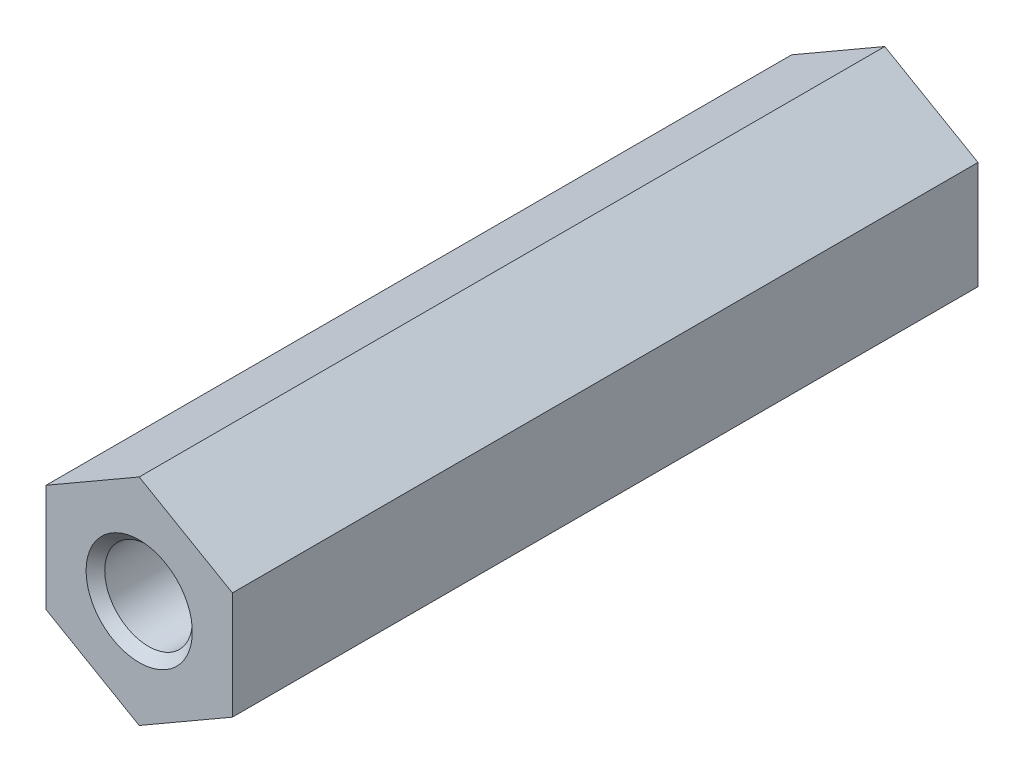
ISO-10303-21;
HEADER;
FILE_DESCRIPTION(('STEP AP214'),'2;1');
FILE_NAME('part.step','',(''),(''),'','','');
FILE_SCHEMA(('AUTOMOTIVE_DESIGN { 1 0 10303 214 1 1 1 1 }'));
ENDSEC;
DATA;
#1=APPLICATION_CONTEXT('core data for automotive mechanical design processes');
#2=APPLICATION_PROTOCOL_DEFINITION('international standard','automotive_design',2000,#1);
#3=PRODUCT_CONTEXT('',#1,'mechanical');
#4=PRODUCT('Part','Part','',(#3));
#5=PRODUCT_RELATED_PRODUCT_CATEGORY('part','',(#4));
#6=PRODUCT_DEFINITION_FORMATION('','',#4);
#7=PRODUCT_DEFINITION_CONTEXT('part definition',#1,'design');
#8=PRODUCT_DEFINITION('design','',#6,#7);
#9=PRODUCT_DEFINITION_SHAPE('','',#8);
#10=(LENGTH_UNIT() NAMED_UNIT(*) SI_UNIT(.MILLI.,.METRE.));
#11=(NAMED_UNIT(*) PLANE_ANGLE_UNIT() SI_UNIT($,.RADIAN.));
#12=(NAMED_UNIT(*) SI_UNIT($,.STERADIAN.) SOLID_ANGLE_UNIT());
#13=UNCERTAINTY_MEASURE_WITH_UNIT(LENGTH_MEASURE(1.E-05),#10,'distance_accuracy_value','');
#14=(GEOMETRIC_REPRESENTATION_CONTEXT(3) GLOBAL_UNCERTAINTY_ASSIGNED_CONTEXT((#13)) GLOBAL_UNIT_ASSIGNED_CONTEXT((#10,
#11,#12)) REPRESENTATION_CONTEXT('',''));
#15=CARTESIAN_POINT('',(0.,0.,0.));
#16=DIRECTION('',(0.,0.,1.));
#17=DIRECTION('',(1.,0.,0.));
#18=AXIS2_PLACEMENT_3D('',#15,#16,#17);
#19=CARTESIAN_POINT('',(0.,5.77350277792815,40.));
#20=DIRECTION('',(0.499999999999999,0.866025403784439,0.));
#21=DIRECTION('',(-0.866025403784439,0.499999999999999,0.));
#22=AXIS2_PLACEMENT_3D('',#19,#20,#21);
#23=PLANE('',#22);
#24=DIRECTION('',(0.866025403784439,-0.499999999999999,0.));
#25=VECTOR('',#24,1.);
#26=CARTESIAN_POINT('',(0.,5.77350277792815,0.));
#27=LINE('',#26,#25);
#28=CARTESIAN_POINT('',(0.,5.77350277792815,0.));
#29=VERTEX_POINT('',#28);
#30=CARTESIAN_POINT('',(5.00000007450581,2.88675138896408,0.));
#31=VERTEX_POINT('',#30);
#32=EDGE_CURVE('E127',#29,#31,#27,.T.);
#33=ORIENTED_EDGE('',*,*,#32,.F.);
#34=DIRECTION('',(0.,0.,-1.));
#35=VECTOR('',#34,1.);
#36=CARTESIAN_POINT('',(0.,5.77350277792815,40.));
#37=LINE('',#36,#35);
#38=CARTESIAN_POINT('',(0.,5.77350277792815,40.));
#39=VERTEX_POINT('',#38);
#40=EDGE_CURVE('E56',#39,#29,#37,.T.);
#41=ORIENTED_EDGE('',*,*,#40,.F.);
#42=DIRECTION('',(0.866025403784439,-0.499999999999999,0.));
#43=VECTOR('',#42,1.);
#44=CARTESIAN_POINT('',(0.,5.77350277792815,40.));
#45=LINE('',#44,#43);
#46=CARTESIAN_POINT('',(5.00000007450581,2.88675138896408,40.));
#47=VERTEX_POINT('',#46);
#48=EDGE_CURVE('E142',#39,#47,#45,.T.);
#49=ORIENTED_EDGE('',*,*,#48,.T.);
#50=DIRECTION('',(0.,0.,-1.));
#51=VECTOR('',#50,1.);
#52=CARTESIAN_POINT('',(5.00000007450581,2.88675138896408,40.));
#53=LINE('',#52,#51);
#54=EDGE_CURVE('E91',#47,#31,#53,.T.);
#55=ORIENTED_EDGE('',*,*,#54,.T.);
#56=EDGE_LOOP('',(#33,#41,#49,#55));
#57=FACE_BOUND('',#56,.T.);
#58=ADVANCED_FACE('F38',(#57),#23,.T.);
#59=CARTESIAN_POINT('',(-5.0000000745058,2.88675138896408,40.));
#60=DIRECTION('',(-0.5,0.866025403784439,0.));
#61=DIRECTION('',(-0.866025403784439,-0.5,0.));
#62=AXIS2_PLACEMENT_3D('',#59,#60,#61);
#63=PLANE('',#62);
#64=DIRECTION('',(0.866025403784439,0.5,0.));
#65=VECTOR('',#64,1.);
#66=CARTESIAN_POINT('',(-5.0000000745058,2.88675138896408,0.));
#67=LINE('',#66,#65);
#68=CARTESIAN_POINT('',(-5.0000000745058,2.88675138896408,0.));
#69=VERTEX_POINT('',#68);
#70=EDGE_CURVE('E139',#69,#29,#67,.T.);
#71=ORIENTED_EDGE('',*,*,#70,.F.);
#72=DIRECTION('',(0.,0.,-1.));
#73=VECTOR('',#72,1.);
#74=CARTESIAN_POINT('',(-5.0000000745058,2.88675138896408,40.));
#75=LINE('',#74,#73);
#76=CARTESIAN_POINT('',(-5.0000000745058,2.88675138896408,40.));
#77=VERTEX_POINT('',#76);
#78=EDGE_CURVE('E79',#77,#69,#75,.T.);
#79=ORIENTED_EDGE('',*,*,#78,.F.);
#80=DIRECTION('',(0.866025403784439,0.5,0.));
#81=VECTOR('',#80,1.);
#82=CARTESIAN_POINT('',(-5.0000000745058,2.88675138896408,40.));
#83=LINE('',#82,#81);
#84=EDGE_CURVE('E117',#77,#39,#83,.T.);
#85=ORIENTED_EDGE('',*,*,#84,.T.);
#86=ORIENTED_EDGE('',*,*,#40,.T.);
#87=EDGE_LOOP('',(#71,#79,#85,#86));
#88=FACE_BOUND('',#87,.T.);
#89=ADVANCED_FACE('F186',(#88),#63,.T.);
#90=CARTESIAN_POINT('',(-5.00000007450581,-2.88675138896407,40.));
#91=DIRECTION('',(-1.,0.,0.));
#92=DIRECTION('',(0.,-1.,0.));
#93=AXIS2_PLACEMENT_3D('',#90,#91,#92);
#94=PLANE('',#93);
#95=DIRECTION('',(0.,1.,0.));
#96=VECTOR('',#95,1.);
#97=CARTESIAN_POINT('',(-5.00000007450581,-2.88675138896407,0.));
#98=LINE('',#97,#96);
#99=CARTESIAN_POINT('',(-5.00000007450581,-2.88675138896407,0.));
#100=VERTEX_POINT('',#99);
#101=EDGE_CURVE('E104',#100,#69,#98,.T.);
#102=ORIENTED_EDGE('',*,*,#101,.F.);
#103=DIRECTION('',(0.,0.,-1.));
#104=VECTOR('',#103,1.);
#105=CARTESIAN_POINT('',(-5.00000007450581,-2.88675138896407,40.));
#106=LINE('',#105,#104);
#107=CARTESIAN_POINT('',(-5.00000007450581,-2.88675138896407,40.));
#108=VERTEX_POINT('',#107);
#109=EDGE_CURVE('E99',#108,#100,#106,.T.);
#110=ORIENTED_EDGE('',*,*,#109,.F.);
#111=DIRECTION('',(0.,1.,0.));
#112=VECTOR('',#111,1.);
#113=CARTESIAN_POINT('',(-5.00000007450581,-2.88675138896407,40.));
#114=LINE('',#113,#112);
#115=EDGE_CURVE('E102',#108,#77,#114,.T.);
#116=ORIENTED_EDGE('',*,*,#115,.T.);
#117=ORIENTED_EDGE('',*,*,#78,.T.);
#118=EDGE_LOOP('',(#102,#110,#116,#117));
#119=FACE_BOUND('',#118,.T.);
#120=ADVANCED_FACE('F101',(#119),#94,.T.);
#121=CARTESIAN_POINT('',(0.,-5.77350277792815,40.));
#122=DIRECTION('',(-0.500000000000001,-0.866025403784438,0.));
#123=DIRECTION('',(0.866025403784438,-0.500000000000001,0.));
#124=AXIS2_PLACEMENT_3D('',#121,#122,#123);
#125=PLANE('',#124);
#126=DIRECTION('',(-0.866025403784438,0.500000000000001,0.));
#127=VECTOR('',#126,1.);
#128=CARTESIAN_POINT('',(0.,-5.77350277792815,0.));
#129=LINE('',#128,#127);
#130=CARTESIAN_POINT('',(0.,-5.77350277792815,0.));
#131=VERTEX_POINT('',#130);
#132=EDGE_CURVE('E136',#131,#100,#129,.T.);
#133=ORIENTED_EDGE('',*,*,#132,.F.);
#134=DIRECTION('',(0.,0.,-1.));
#135=VECTOR('',#134,1.);
#136=CARTESIAN_POINT('',(0.,-5.77350277792815,40.));
#137=LINE('',#136,#135);
#138=CARTESIAN_POINT('',(0.,-5.77350277792815,40.));
#139=VERTEX_POINT('',#138);
#140=EDGE_CURVE('E109',#139,#131,#137,.T.);
#141=ORIENTED_EDGE('',*,*,#140,.F.);
#142=DIRECTION('',(-0.866025403784438,0.500000000000001,0.));
#143=VECTOR('',#142,1.);
#144=CARTESIAN_POINT('',(0.,-5.77350277792815,40.));
#145=LINE('',#144,#143);
#146=EDGE_CURVE('E115',#139,#108,#145,.T.);
#147=ORIENTED_EDGE('',*,*,#146,.T.);
#148=ORIENTED_EDGE('',*,*,#109,.T.);
#149=EDGE_LOOP('',(#133,#141,#147,#148));
#150=FACE_BOUND('',#149,.T.);
#151=ADVANCED_FACE('F119',(#150),#125,.T.);
#152=CARTESIAN_POINT('',(5.0000000745058,-2.88675138896408,40.));
#153=DIRECTION('',(0.5,-0.866025403784439,0.));
#154=DIRECTION('',(0.866025403784439,0.5,0.));
#155=AXIS2_PLACEMENT_3D('',#152,#153,#154);
#156=PLANE('',#155);
#157=DIRECTION('',(-0.866025403784439,-0.499999999999999,0.));
#158=VECTOR('',#157,1.);
#159=CARTESIAN_POINT('',(5.0000000745058,-2.88675138896408,0.));
#160=LINE('',#159,#158);
#161=CARTESIAN_POINT('',(5.0000000745058,-2.88675138896408,0.));
#162=VERTEX_POINT('',#161);
#163=EDGE_CURVE('E133',#162,#131,#160,.T.);
#164=ORIENTED_EDGE('',*,*,#163,.F.);
#165=DIRECTION('',(0.,0.,-1.));
#166=VECTOR('',#165,1.);
#167=CARTESIAN_POINT('',(5.0000000745058,-2.88675138896408,40.));
#168=LINE('',#167,#166);
#169=CARTESIAN_POINT('',(5.0000000745058,-2.88675138896408,40.));
#170=VERTEX_POINT('',#169);
#171=EDGE_CURVE('E147',#170,#162,#168,.T.);
#172=ORIENTED_EDGE('',*,*,#171,.F.);
#173=DIRECTION('',(-0.866025403784439,-0.499999999999999,0.));
#174=VECTOR('',#173,1.);
#175=CARTESIAN_POINT('',(5.0000000745058,-2.88675138896408,40.));
#176=LINE('',#175,#174);
#177=EDGE_CURVE('E120',#170,#139,#176,.T.);
#178=ORIENTED_EDGE('',*,*,#177,.T.);
#179=ORIENTED_EDGE('',*,*,#140,.T.);
#180=EDGE_LOOP('',(#164,#172,#178,#179));
#181=FACE_BOUND('',#180,.T.);
#182=ADVANCED_FACE('F183',(#181),#156,.T.);
#183=CARTESIAN_POINT('',(5.00000007450581,2.88675138896408,40.));
#184=DIRECTION('',(1.,0.,0.));
#185=DIRECTION('',(0.,1.,0.));
#186=AXIS2_PLACEMENT_3D('',#183,#184,#185);
#187=PLANE('',#186);
#188=DIRECTION('',(0.,-1.,0.));
#189=VECTOR('',#188,1.);
#190=CARTESIAN_POINT('',(5.00000007450581,2.88675138896408,0.));
#191=LINE('',#190,#189);
#192=EDGE_CURVE('E130',#31,#162,#191,.T.);
#193=ORIENTED_EDGE('',*,*,#192,.F.);
#194=ORIENTED_EDGE('',*,*,#54,.F.);
#195=DIRECTION('',(0.,-1.,0.));
#196=VECTOR('',#195,1.);
#197=CARTESIAN_POINT('',(5.00000007450581,2.88675138896408,40.));
#198=LINE('',#197,#196);
#199=EDGE_CURVE('E122',#47,#170,#198,.T.);
#200=ORIENTED_EDGE('',*,*,#199,.T.);
#201=ORIENTED_EDGE('',*,*,#171,.T.);
#202=EDGE_LOOP('',(#193,#194,#200,#201));
#203=FACE_BOUND('',#202,.T.);
#204=ADVANCED_FACE('F176',(#203),#187,.T.);
#205=CARTESIAN_POINT('',(0.,0.,40.));
#206=DIRECTION('',(0.,0.,-1.));
#207=DIRECTION('',(-1.,0.,0.));
#208=AXIS2_PLACEMENT_3D('',#205,#206,#207);
#209=PLANE('',#208);
#210=CARTESIAN_POINT('',(0.,0.,40.));
#211=DIRECTION('',(0.,0.,-1.));
#212=DIRECTION('',(-1.,0.,0.));
#213=AXIS2_PLACEMENT_3D('',#210,#211,#212);
#214=CIRCLE('',#213,2.84999999999999);
#215=CARTESIAN_POINT('',(-2.84999999999999,0.,40.));
#216=VERTEX_POINT('',#215);
#217=EDGE_CURVE('E11',#216,#216,#214,.T.);
#218=ORIENTED_EDGE('',*,*,#217,.T.);
#219=EDGE_LOOP('',(#218));
#220=FACE_BOUND('',#219,.T.);
#221=ORIENTED_EDGE('',*,*,#48,.F.);
#222=ORIENTED_EDGE('',*,*,#84,.F.);
#223=ORIENTED_EDGE('',*,*,#115,.F.);
#224=ORIENTED_EDGE('',*,*,#146,.F.);
#225=ORIENTED_EDGE('',*,*,#177,.F.);
#226=ORIENTED_EDGE('',*,*,#199,.F.);
#227=EDGE_LOOP('',(#221,#222,#223,#224,#225,#226));
#228=FACE_BOUND('',#227,.T.);
#229=ADVANCED_FACE('F113',(#220,#228),#209,.F.);
#230=CARTESIAN_POINT('',(0.,0.,0.));
#231=DIRECTION('',(0.,0.,-1.));
#232=DIRECTION('',(-1.,0.,0.));
#233=AXIS2_PLACEMENT_3D('',#230,#231,#232);
#234=PLANE('',#233);
#235=CARTESIAN_POINT('',(0.,0.,0.));
#236=DIRECTION('',(0.,0.,-1.));
#237=DIRECTION('',(-1.,0.,0.));
#238=AXIS2_PLACEMENT_3D('',#235,#236,#237);
#239=CIRCLE('',#238,2.84999999999999);
#240=CARTESIAN_POINT('',(-2.84999999999999,0.,0.));
#241=VERTEX_POINT('',#240);
#242=EDGE_CURVE('E48',#241,#241,#239,.F.);
#243=ORIENTED_EDGE('',*,*,#242,.T.);
#244=EDGE_LOOP('',(#243));
#245=FACE_BOUND('',#244,.T.);
#246=ORIENTED_EDGE('',*,*,#32,.T.);
#247=ORIENTED_EDGE('',*,*,#192,.T.);
#248=ORIENTED_EDGE('',*,*,#163,.T.);
#249=ORIENTED_EDGE('',*,*,#132,.T.);
#250=ORIENTED_EDGE('',*,*,#101,.T.);
#251=ORIENTED_EDGE('',*,*,#70,.T.);
#252=EDGE_LOOP('',(#246,#247,#248,#249,#250,#251));
#253=FACE_BOUND('',#252,.T.);
#254=ADVANCED_FACE('F157',(#245,#253),#234,.T.);
#255=CARTESIAN_POINT('',(0.,0.,40.));
#256=DIRECTION('',(0.,0.,-1.));
#257=DIRECTION('',(-1.,0.,0.));
#258=AXIS2_PLACEMENT_3D('',#255,#256,#257);
#259=CYLINDRICAL_SURFACE('',#258,2.35);
#260=CARTESIAN_POINT('',(0.,0.,0.499999999999987));
#261=DIRECTION('',(0.,0.,-1.));
#262=DIRECTION('',(-1.,0.,0.));
#263=AXIS2_PLACEMENT_3D('',#260,#261,#262);
#264=CIRCLE('',#263,2.35);
#265=CARTESIAN_POINT('',(-2.35,0.,0.499999999999987));
#266=VERTEX_POINT('',#265);
#267=EDGE_CURVE('E152',#266,#266,#264,.T.);
#268=ORIENTED_EDGE('',*,*,#267,.T.);
#269=EDGE_LOOP('',(#268));
#270=FACE_BOUND('',#269,.T.);
#271=CARTESIAN_POINT('',(0.,0.,39.5));
#272=DIRECTION('',(0.,0.,-1.));
#273=DIRECTION('',(-1.,0.,0.));
#274=AXIS2_PLACEMENT_3D('',#271,#272,#273);
#275=CIRCLE('',#274,2.35);
#276=CARTESIAN_POINT('',(-2.35,0.,39.5));
#277=VERTEX_POINT('',#276);
#278=EDGE_CURVE('E144',#277,#277,#275,.F.);
#279=ORIENTED_EDGE('',*,*,#278,.T.);
#280=EDGE_LOOP('',(#279));
#281=FACE_BOUND('',#280,.T.);
#282=ADVANCED_FACE('F163',(#270,#281),#259,.F.);
#283=CARTESIAN_POINT('',(0.,0.,0.499999999999987));
#284=DIRECTION('',(0.,0.,-1.));
#285=DIRECTION('',(-1.,0.,0.));
#286=AXIS2_PLACEMENT_3D('',#283,#284,#285);
#287=CONICAL_SURFACE('',#286,2.35,0.785398163397457);
#288=ORIENTED_EDGE('',*,*,#242,.F.);
#289=EDGE_LOOP('',(#288));
#290=FACE_BOUND('',#289,.T.);
#291=ORIENTED_EDGE('',*,*,#267,.F.);
#292=EDGE_LOOP('',(#291));
#293=FACE_BOUND('',#292,.T.);
#294=ADVANCED_FACE('F160',(#290,#293),#287,.F.);
#295=CARTESIAN_POINT('',(0.,0.,40.));
#296=DIRECTION('',(0.,0.,1.));
#297=DIRECTION('',(1.,0.,0.));
#298=AXIS2_PLACEMENT_3D('',#295,#296,#297);
#299=CONICAL_SURFACE('',#298,2.84999999999999,0.785398163397436);
#300=ORIENTED_EDGE('',*,*,#278,.F.);
#301=EDGE_LOOP('',(#300));
#302=FACE_BOUND('',#301,.T.);
#303=ORIENTED_EDGE('',*,*,#217,.F.);
#304=EDGE_LOOP('',(#303));
#305=FACE_BOUND('',#304,.T.);
#306=ADVANCED_FACE('F41',(#302,#305),#299,.F.);
#307=CLOSED_SHELL('',(#58,#89,#120,#151,#182,#204,#229,#254,#282,#294,#306));
#308=MANIFOLD_SOLID_BREP('B2',#307);
#309=ADVANCED_BREP_SHAPE_REPRESENTATION('',(#18,#308),#14);
#310=SHAPE_DEFINITION_REPRESENTATION(#9,#309);
ENDSEC;
END-ISO-10303-21;
